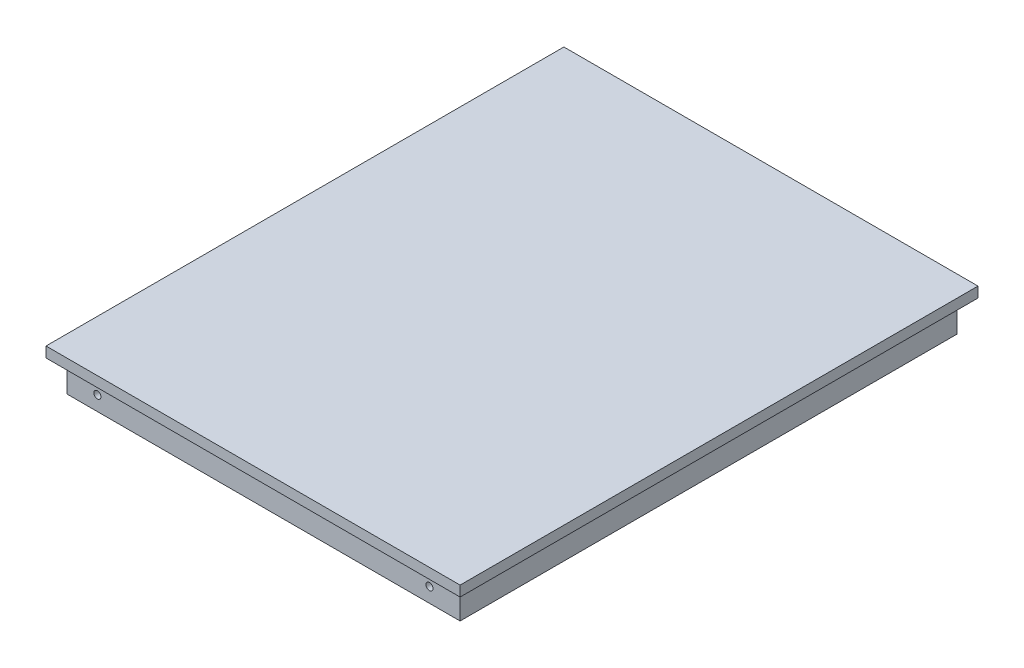
ISO-10303-21;
HEADER;
FILE_DESCRIPTION(('STEP AP214'),'2;1');
FILE_NAME('part.step','',(''),(''),'','','');
FILE_SCHEMA(('AUTOMOTIVE_DESIGN { 1 0 10303 214 1 1 1 1 }'));
ENDSEC;
DATA;
#1=APPLICATION_CONTEXT('core data for automotive mechanical design processes');
#2=APPLICATION_PROTOCOL_DEFINITION('international standard','automotive_design',2000,#1);
#3=PRODUCT_CONTEXT('',#1,'mechanical');
#4=PRODUCT('Part','Part','',(#3));
#5=PRODUCT_RELATED_PRODUCT_CATEGORY('part','',(#4));
#6=PRODUCT_DEFINITION_FORMATION('','',#4);
#7=PRODUCT_DEFINITION_CONTEXT('part definition',#1,'design');
#8=PRODUCT_DEFINITION('design','',#6,#7);
#9=PRODUCT_DEFINITION_SHAPE('','',#8);
#10=(LENGTH_UNIT() NAMED_UNIT(*) SI_UNIT(.MILLI.,.METRE.));
#11=(NAMED_UNIT(*) PLANE_ANGLE_UNIT() SI_UNIT($,.RADIAN.));
#12=(NAMED_UNIT(*) SI_UNIT($,.STERADIAN.) SOLID_ANGLE_UNIT());
#13=UNCERTAINTY_MEASURE_WITH_UNIT(LENGTH_MEASURE(1.E-05),#10,'distance_accuracy_value','');
#14=(GEOMETRIC_REPRESENTATION_CONTEXT(3) GLOBAL_UNCERTAINTY_ASSIGNED_CONTEXT((#13)) GLOBAL_UNIT_ASSIGNED_CONTEXT((#10,
#11,#12)) REPRESENTATION_CONTEXT('',''));
#15=CARTESIAN_POINT('',(0.,0.,0.));
#16=DIRECTION('',(0.,0.,1.));
#17=DIRECTION('',(1.,0.,0.));
#18=AXIS2_PLACEMENT_3D('',#15,#16,#17);
#19=CARTESIAN_POINT('',(0.,0.,0.));
#20=DIRECTION('',(0.,1.,0.));
#21=DIRECTION('',(0.,0.,1.));
#22=AXIS2_PLACEMENT_3D('',#19,#20,#21);
#23=PLANE('',#22);
#24=DIRECTION('',(0.,0.,-1.));
#25=VECTOR('',#24,1.);
#26=CARTESIAN_POINT('',(-99.75,0.,0.));
#27=LINE('',#26,#25);
#28=CARTESIAN_POINT('',(-99.75,0.,124.75));
#29=VERTEX_POINT('',#28);
#30=CARTESIAN_POINT('',(-99.75,0.,-124.75));
#31=VERTEX_POINT('',#30);
#32=EDGE_CURVE('E217',#29,#31,#27,.T.);
#33=ORIENTED_EDGE('',*,*,#32,.T.);
#34=DIRECTION('',(1.,0.,0.));
#35=VECTOR('',#34,1.);
#36=CARTESIAN_POINT('',(0.,0.,-124.75));
#37=LINE('',#36,#35);
#38=CARTESIAN_POINT('',(99.75,0.,-124.75));
#39=VERTEX_POINT('',#38);
#40=EDGE_CURVE('E241',#31,#39,#37,.T.);
#41=ORIENTED_EDGE('',*,*,#40,.T.);
#42=DIRECTION('',(0.,0.,1.));
#43=VECTOR('',#42,1.);
#44=CARTESIAN_POINT('',(99.75,0.,0.));
#45=LINE('',#44,#43);
#46=CARTESIAN_POINT('',(99.75,0.,124.75));
#47=VERTEX_POINT('',#46);
#48=EDGE_CURVE('E261',#39,#47,#45,.T.);
#49=ORIENTED_EDGE('',*,*,#48,.T.);
#50=DIRECTION('',(-1.,0.,0.));
#51=VECTOR('',#50,1.);
#52=CARTESIAN_POINT('',(0.,0.,124.75));
#53=LINE('',#52,#51);
#54=EDGE_CURVE('E257',#47,#29,#53,.T.);
#55=ORIENTED_EDGE('',*,*,#54,.T.);
#56=EDGE_LOOP('',(#33,#41,#49,#55));
#57=FACE_BOUND('',#56,.T.);
#58=DIRECTION('',(0.,0.,-1.));
#59=VECTOR('',#58,1.);
#60=CARTESIAN_POINT('',(-94.75,0.,0.));
#61=LINE('',#60,#59);
#62=CARTESIAN_POINT('',(-94.75,0.,119.75));
#63=VERTEX_POINT('',#62);
#64=CARTESIAN_POINT('',(-94.75,0.,-119.75));
#65=VERTEX_POINT('',#64);
#66=EDGE_CURVE('E194',#63,#65,#61,.T.);
#67=ORIENTED_EDGE('',*,*,#66,.F.);
#68=DIRECTION('',(-1.,0.,0.));
#69=VECTOR('',#68,1.);
#70=CARTESIAN_POINT('',(0.,0.,119.75));
#71=LINE('',#70,#69);
#72=CARTESIAN_POINT('',(94.75,0.,119.75));
#73=VERTEX_POINT('',#72);
#74=EDGE_CURVE('E154',#73,#63,#71,.T.);
#75=ORIENTED_EDGE('',*,*,#74,.F.);
#76=DIRECTION('',(0.,0.,1.));
#77=VECTOR('',#76,1.);
#78=CARTESIAN_POINT('',(94.75,0.,0.));
#79=LINE('',#78,#77);
#80=CARTESIAN_POINT('',(94.75,0.,-119.75));
#81=VERTEX_POINT('',#80);
#82=EDGE_CURVE('E70',#81,#73,#79,.T.);
#83=ORIENTED_EDGE('',*,*,#82,.F.);
#84=DIRECTION('',(1.,0.,0.));
#85=VECTOR('',#84,1.);
#86=CARTESIAN_POINT('',(0.,0.,-119.75));
#87=LINE('',#86,#85);
#88=EDGE_CURVE('E65',#65,#81,#87,.T.);
#89=ORIENTED_EDGE('',*,*,#88,.F.);
#90=EDGE_LOOP('',(#67,#75,#83,#89));
#91=FACE_BOUND('',#90,.T.);
#92=ADVANCED_FACE('F47',(#57,#91),#23,.F.);
#93=CARTESIAN_POINT('',(-99.75,5.,0.));
#94=DIRECTION('',(-1.,0.,0.));
#95=DIRECTION('',(0.,0.,1.));
#96=AXIS2_PLACEMENT_3D('',#93,#94,#95);
#97=PLANE('',#96);
#98=ORIENTED_EDGE('',*,*,#32,.F.);
#99=DIRECTION('',(0.,-1.,0.));
#100=VECTOR('',#99,1.);
#101=CARTESIAN_POINT('',(-99.75,5.,124.75));
#102=LINE('',#101,#100);
#103=CARTESIAN_POINT('',(-99.75,5.,124.75));
#104=VERTEX_POINT('',#103);
#105=EDGE_CURVE('E11',#104,#29,#102,.T.);
#106=ORIENTED_EDGE('',*,*,#105,.F.);
#107=DIRECTION('',(0.,0.,-1.));
#108=VECTOR('',#107,1.);
#109=CARTESIAN_POINT('',(-99.75,5.,0.));
#110=LINE('',#109,#108);
#111=CARTESIAN_POINT('',(-99.75,5.,-124.75));
#112=VERTEX_POINT('',#111);
#113=EDGE_CURVE('E236',#104,#112,#110,.T.);
#114=ORIENTED_EDGE('',*,*,#113,.T.);
#115=DIRECTION('',(0.,-1.,0.));
#116=VECTOR('',#115,1.);
#117=CARTESIAN_POINT('',(-99.75,5.,-124.75));
#118=LINE('',#117,#116);
#119=EDGE_CURVE('E253',#112,#31,#118,.T.);
#120=ORIENTED_EDGE('',*,*,#119,.T.);
#121=EDGE_LOOP('',(#98,#106,#114,#120));
#122=FACE_BOUND('',#121,.T.);
#123=ADVANCED_FACE('F49',(#122),#97,.T.);
#124=CARTESIAN_POINT('',(0.,5.,124.75));
#125=DIRECTION('',(0.,0.,1.));
#126=DIRECTION('',(1.,0.,0.));
#127=AXIS2_PLACEMENT_3D('',#124,#125,#126);
#128=PLANE('',#127);
#129=ORIENTED_EDGE('',*,*,#54,.F.);
#130=DIRECTION('',(0.,-1.,0.));
#131=VECTOR('',#130,1.);
#132=CARTESIAN_POINT('',(99.75,5.,124.75));
#133=LINE('',#132,#131);
#134=CARTESIAN_POINT('',(99.75,5.,124.75));
#135=VERTEX_POINT('',#134);
#136=EDGE_CURVE('E57',#135,#47,#133,.T.);
#137=ORIENTED_EDGE('',*,*,#136,.F.);
#138=DIRECTION('',(-1.,0.,0.));
#139=VECTOR('',#138,1.);
#140=CARTESIAN_POINT('',(0.,5.,124.75));
#141=LINE('',#140,#139);
#142=EDGE_CURVE('E240',#135,#104,#141,.T.);
#143=ORIENTED_EDGE('',*,*,#142,.T.);
#144=ORIENTED_EDGE('',*,*,#105,.T.);
#145=EDGE_LOOP('',(#129,#137,#143,#144));
#146=FACE_BOUND('',#145,.T.);
#147=ADVANCED_FACE('F351',(#146),#128,.T.);
#148=CARTESIAN_POINT('',(99.75,5.,0.));
#149=DIRECTION('',(1.,0.,0.));
#150=DIRECTION('',(0.,0.,-1.));
#151=AXIS2_PLACEMENT_3D('',#148,#149,#150);
#152=PLANE('',#151);
#153=ORIENTED_EDGE('',*,*,#48,.F.);
#154=DIRECTION('',(0.,-1.,0.));
#155=VECTOR('',#154,1.);
#156=CARTESIAN_POINT('',(99.75,5.,-124.75));
#157=LINE('',#156,#155);
#158=CARTESIAN_POINT('',(99.75,5.,-124.75));
#159=VERTEX_POINT('',#158);
#160=EDGE_CURVE('E270',#159,#39,#157,.T.);
#161=ORIENTED_EDGE('',*,*,#160,.F.);
#162=DIRECTION('',(0.,0.,1.));
#163=VECTOR('',#162,1.);
#164=CARTESIAN_POINT('',(99.75,5.,0.));
#165=LINE('',#164,#163);
#166=EDGE_CURVE('E245',#159,#135,#165,.T.);
#167=ORIENTED_EDGE('',*,*,#166,.T.);
#168=ORIENTED_EDGE('',*,*,#136,.T.);
#169=EDGE_LOOP('',(#153,#161,#167,#168));
#170=FACE_BOUND('',#169,.T.);
#171=ADVANCED_FACE('F398',(#170),#152,.T.);
#172=CARTESIAN_POINT('',(0.,5.,-124.75));
#173=DIRECTION('',(0.,0.,-1.));
#174=DIRECTION('',(-1.,0.,0.));
#175=AXIS2_PLACEMENT_3D('',#172,#173,#174);
#176=PLANE('',#175);
#177=ORIENTED_EDGE('',*,*,#40,.F.);
#178=ORIENTED_EDGE('',*,*,#119,.F.);
#179=DIRECTION('',(1.,0.,0.));
#180=VECTOR('',#179,1.);
#181=CARTESIAN_POINT('',(0.,5.,-124.75));
#182=LINE('',#181,#180);
#183=EDGE_CURVE('E249',#112,#159,#182,.T.);
#184=ORIENTED_EDGE('',*,*,#183,.T.);
#185=ORIENTED_EDGE('',*,*,#160,.T.);
#186=EDGE_LOOP('',(#177,#178,#184,#185));
#187=FACE_BOUND('',#186,.T.);
#188=ADVANCED_FACE('F393',(#187),#176,.T.);
#189=CARTESIAN_POINT('',(0.,5.,0.));
#190=DIRECTION('',(0.,1.,0.));
#191=DIRECTION('',(0.,0.,1.));
#192=AXIS2_PLACEMENT_3D('',#189,#190,#191);
#193=PLANE('',#192);
#194=ORIENTED_EDGE('',*,*,#113,.F.);
#195=ORIENTED_EDGE('',*,*,#142,.F.);
#196=ORIENTED_EDGE('',*,*,#166,.F.);
#197=ORIENTED_EDGE('',*,*,#183,.F.);
#198=EDGE_LOOP('',(#194,#195,#196,#197));
#199=FACE_BOUND('',#198,.T.);
#200=ADVANCED_FACE('F311',(#199),#193,.T.);
#201=CARTESIAN_POINT('',(0.,-15.,114.75));
#202=DIRECTION('',(0.,0.,-1.));
#203=DIRECTION('',(-1.,0.,0.));
#204=AXIS2_PLACEMENT_3D('',#201,#202,#203);
#205=PLANE('',#204);
#206=CARTESIAN_POINT('',(-80.,-8.00000000000001,114.75));
#207=DIRECTION('',(0.,0.,-1.));
#208=DIRECTION('',(-1.,0.,0.));
#209=AXIS2_PLACEMENT_3D('',#206,#207,#208);
#210=CIRCLE('',#209,1.69999999999997);
#211=CARTESIAN_POINT('',(-81.7,-8.00000000000001,114.75));
#212=VERTEX_POINT('',#211);
#213=EDGE_CURVE('E279',#212,#212,#210,.T.);
#214=ORIENTED_EDGE('',*,*,#213,.F.);
#215=EDGE_LOOP('',(#214));
#216=FACE_BOUND('',#215,.T.);
#217=CARTESIAN_POINT('',(80.,-7.99999999999999,114.75));
#218=DIRECTION('',(0.,0.,-1.));
#219=DIRECTION('',(-1.,0.,0.));
#220=AXIS2_PLACEMENT_3D('',#217,#218,#219);
#221=CIRCLE('',#220,1.69999999999997);
#222=CARTESIAN_POINT('',(78.3,-7.99999999999999,114.75));
#223=VERTEX_POINT('',#222);
#224=EDGE_CURVE('E171',#223,#223,#221,.T.);
#225=ORIENTED_EDGE('',*,*,#224,.F.);
#226=EDGE_LOOP('',(#225));
#227=FACE_BOUND('',#226,.T.);
#228=DIRECTION('',(-1.,0.,0.));
#229=VECTOR('',#228,1.);
#230=CARTESIAN_POINT('',(0.,0.,114.75));
#231=LINE('',#230,#229);
#232=CARTESIAN_POINT('',(89.75,0.,114.75));
#233=VERTEX_POINT('',#232);
#234=CARTESIAN_POINT('',(-89.75,0.,114.75));
#235=VERTEX_POINT('',#234);
#236=EDGE_CURVE('E203',#233,#235,#231,.T.);
#237=ORIENTED_EDGE('',*,*,#236,.F.);
#238=DIRECTION('',(0.,1.,0.));
#239=VECTOR('',#238,1.);
#240=CARTESIAN_POINT('',(89.75,-15.,114.75));
#241=LINE('',#240,#239);
#242=CARTESIAN_POINT('',(89.75,-15.,114.75));
#243=VERTEX_POINT('',#242);
#244=EDGE_CURVE('E214',#243,#233,#241,.T.);
#245=ORIENTED_EDGE('',*,*,#244,.F.);
#246=DIRECTION('',(-1.,0.,0.));
#247=VECTOR('',#246,1.);
#248=CARTESIAN_POINT('',(0.,-15.,114.75));
#249=LINE('',#248,#247);
#250=CARTESIAN_POINT('',(-89.75,-15.,114.75));
#251=VERTEX_POINT('',#250);
#252=EDGE_CURVE('E179',#243,#251,#249,.T.);
#253=ORIENTED_EDGE('',*,*,#252,.T.);
#254=DIRECTION('',(0.,1.,0.));
#255=VECTOR('',#254,1.);
#256=CARTESIAN_POINT('',(-89.75,-15.,114.75));
#257=LINE('',#256,#255);
#258=EDGE_CURVE('E225',#251,#235,#257,.T.);
#259=ORIENTED_EDGE('',*,*,#258,.T.);
#260=EDGE_LOOP('',(#237,#245,#253,#259));
#261=FACE_BOUND('',#260,.T.);
#262=ADVANCED_FACE('F307',(#216,#227,#261),#205,.T.);
#263=CARTESIAN_POINT('',(89.75,-15.,0.));
#264=DIRECTION('',(-1.,0.,0.));
#265=DIRECTION('',(0.,0.,1.));
#266=AXIS2_PLACEMENT_3D('',#263,#264,#265);
#267=PLANE('',#266);
#268=DIRECTION('',(0.,0.,1.));
#269=VECTOR('',#268,1.);
#270=CARTESIAN_POINT('',(89.75,0.,0.));
#271=LINE('',#270,#269);
#272=CARTESIAN_POINT('',(89.75,0.,-114.75));
#273=VERTEX_POINT('',#272);
#274=EDGE_CURVE('E164',#273,#233,#271,.T.);
#275=ORIENTED_EDGE('',*,*,#274,.F.);
#276=DIRECTION('',(0.,1.,0.));
#277=VECTOR('',#276,1.);
#278=CARTESIAN_POINT('',(89.75,-15.,-114.75));
#279=LINE('',#278,#277);
#280=CARTESIAN_POINT('',(89.75,-15.,-114.75));
#281=VERTEX_POINT('',#280);
#282=EDGE_CURVE('E218',#281,#273,#279,.T.);
#283=ORIENTED_EDGE('',*,*,#282,.F.);
#284=DIRECTION('',(0.,0.,1.));
#285=VECTOR('',#284,1.);
#286=CARTESIAN_POINT('',(89.75,-15.,0.));
#287=LINE('',#286,#285);
#288=EDGE_CURVE('E159',#281,#243,#287,.T.);
#289=ORIENTED_EDGE('',*,*,#288,.T.);
#290=ORIENTED_EDGE('',*,*,#244,.T.);
#291=EDGE_LOOP('',(#275,#283,#289,#290));
#292=FACE_BOUND('',#291,.T.);
#293=ADVANCED_FACE('F310',(#292),#267,.T.);
#294=CARTESIAN_POINT('',(0.,-15.,-114.75));
#295=DIRECTION('',(0.,0.,1.));
#296=DIRECTION('',(1.,0.,0.));
#297=AXIS2_PLACEMENT_3D('',#294,#295,#296);
#298=PLANE('',#297);
#299=CARTESIAN_POINT('',(-80.,-8.00000000000001,-114.75));
#300=DIRECTION('',(0.,0.,1.));
#301=DIRECTION('',(1.,0.,0.));
#302=AXIS2_PLACEMENT_3D('',#299,#300,#301);
#303=CIRCLE('',#302,1.69999999999997);
#304=CARTESIAN_POINT('',(-78.3,-8.00000000000001,-114.75));
#305=VERTEX_POINT('',#304);
#306=EDGE_CURVE('E287',#305,#305,#303,.T.);
#307=ORIENTED_EDGE('',*,*,#306,.F.);
#308=EDGE_LOOP('',(#307));
#309=FACE_BOUND('',#308,.T.);
#310=CARTESIAN_POINT('',(80.,-7.99999999999999,-114.75));
#311=DIRECTION('',(0.,0.,1.));
#312=DIRECTION('',(1.,0.,0.));
#313=AXIS2_PLACEMENT_3D('',#310,#311,#312);
#314=CIRCLE('',#313,1.69999999999997);
#315=CARTESIAN_POINT('',(81.7,-7.99999999999999,-114.75));
#316=VERTEX_POINT('',#315);
#317=EDGE_CURVE('E284',#316,#316,#314,.T.);
#318=ORIENTED_EDGE('',*,*,#317,.F.);
#319=EDGE_LOOP('',(#318));
#320=FACE_BOUND('',#319,.T.);
#321=DIRECTION('',(1.,0.,0.));
#322=VECTOR('',#321,1.);
#323=CARTESIAN_POINT('',(0.,0.,-114.75));
#324=LINE('',#323,#322);
#325=CARTESIAN_POINT('',(-89.75,0.,-114.75));
#326=VERTEX_POINT('',#325);
#327=EDGE_CURVE('E168',#326,#273,#324,.T.);
#328=ORIENTED_EDGE('',*,*,#327,.F.);
#329=DIRECTION('',(0.,1.,0.));
#330=VECTOR('',#329,1.);
#331=CARTESIAN_POINT('',(-89.75,-15.,-114.75));
#332=LINE('',#331,#330);
#333=CARTESIAN_POINT('',(-89.75,-15.,-114.75));
#334=VERTEX_POINT('',#333);
#335=EDGE_CURVE('E221',#334,#326,#332,.T.);
#336=ORIENTED_EDGE('',*,*,#335,.F.);
#337=DIRECTION('',(1.,0.,0.));
#338=VECTOR('',#337,1.);
#339=CARTESIAN_POINT('',(0.,-15.,-114.75));
#340=LINE('',#339,#338);
#341=EDGE_CURVE('E187',#334,#281,#340,.T.);
#342=ORIENTED_EDGE('',*,*,#341,.T.);
#343=ORIENTED_EDGE('',*,*,#282,.T.);
#344=EDGE_LOOP('',(#328,#336,#342,#343));
#345=FACE_BOUND('',#344,.T.);
#346=ADVANCED_FACE('F329',(#309,#320,#345),#298,.T.);
#347=CARTESIAN_POINT('',(-94.75,-15.,0.));
#348=DIRECTION('',(1.,0.,0.));
#349=DIRECTION('',(0.,0.,-1.));
#350=AXIS2_PLACEMENT_3D('',#347,#348,#349);
#351=PLANE('',#350);
#352=ORIENTED_EDGE('',*,*,#66,.T.);
#353=DIRECTION('',(0.,1.,0.));
#354=VECTOR('',#353,1.);
#355=CARTESIAN_POINT('',(-94.75,-15.,-119.75));
#356=LINE('',#355,#354);
#357=CARTESIAN_POINT('',(-94.75,-15.,-119.75));
#358=VERTEX_POINT('',#357);
#359=EDGE_CURVE('E162',#358,#65,#356,.T.);
#360=ORIENTED_EDGE('',*,*,#359,.F.);
#361=DIRECTION('',(0.,0.,-1.));
#362=VECTOR('',#361,1.);
#363=CARTESIAN_POINT('',(-94.75,-15.,0.));
#364=LINE('',#363,#362);
#365=CARTESIAN_POINT('',(-94.75,-15.,119.75));
#366=VERTEX_POINT('',#365);
#367=EDGE_CURVE('E141',#366,#358,#364,.T.);
#368=ORIENTED_EDGE('',*,*,#367,.F.);
#369=DIRECTION('',(0.,1.,0.));
#370=VECTOR('',#369,1.);
#371=CARTESIAN_POINT('',(-94.75,-15.,119.75));
#372=LINE('',#371,#370);
#373=EDGE_CURVE('E152',#366,#63,#372,.T.);
#374=ORIENTED_EDGE('',*,*,#373,.T.);
#375=EDGE_LOOP('',(#352,#360,#368,#374));
#376=FACE_BOUND('',#375,.T.);
#377=ADVANCED_FACE('F161',(#376),#351,.F.);
#378=CARTESIAN_POINT('',(0.,-15.,-119.75));
#379=DIRECTION('',(0.,0.,1.));
#380=DIRECTION('',(1.,0.,0.));
#381=AXIS2_PLACEMENT_3D('',#378,#379,#380);
#382=PLANE('',#381);
#383=CARTESIAN_POINT('',(-80.,-8.00000000000001,-119.75));
#384=DIRECTION('',(0.,0.,1.));
#385=DIRECTION('',(1.,0.,0.));
#386=AXIS2_PLACEMENT_3D('',#383,#384,#385);
#387=CIRCLE('',#386,1.69999999999997);
#388=CARTESIAN_POINT('',(-78.3,-8.00000000000001,-119.75));
#389=VERTEX_POINT('',#388);
#390=EDGE_CURVE('E51',#389,#389,#387,.T.);
#391=ORIENTED_EDGE('',*,*,#390,.T.);
#392=EDGE_LOOP('',(#391));
#393=FACE_BOUND('',#392,.T.);
#394=CARTESIAN_POINT('',(80.,-7.99999999999999,-119.75));
#395=DIRECTION('',(0.,0.,1.));
#396=DIRECTION('',(1.,0.,0.));
#397=AXIS2_PLACEMENT_3D('',#394,#395,#396);
#398=CIRCLE('',#397,1.69999999999997);
#399=CARTESIAN_POINT('',(81.7,-7.99999999999999,-119.75));
#400=VERTEX_POINT('',#399);
#401=EDGE_CURVE('E283',#400,#400,#398,.T.);
#402=ORIENTED_EDGE('',*,*,#401,.T.);
#403=EDGE_LOOP('',(#402));
#404=FACE_BOUND('',#403,.T.);
#405=ORIENTED_EDGE('',*,*,#88,.T.);
#406=DIRECTION('',(0.,1.,0.));
#407=VECTOR('',#406,1.);
#408=CARTESIAN_POINT('',(94.75,-15.,-119.75));
#409=LINE('',#408,#407);
#410=CARTESIAN_POINT('',(94.75,-15.,-119.75));
#411=VERTEX_POINT('',#410);
#412=EDGE_CURVE('E230',#411,#81,#409,.T.);
#413=ORIENTED_EDGE('',*,*,#412,.F.);
#414=DIRECTION('',(1.,0.,0.));
#415=VECTOR('',#414,1.);
#416=CARTESIAN_POINT('',(0.,-15.,-119.75));
#417=LINE('',#416,#415);
#418=EDGE_CURVE('E176',#358,#411,#417,.T.);
#419=ORIENTED_EDGE('',*,*,#418,.F.);
#420=ORIENTED_EDGE('',*,*,#359,.T.);
#421=EDGE_LOOP('',(#405,#413,#419,#420));
#422=FACE_BOUND('',#421,.T.);
#423=ADVANCED_FACE('F338',(#393,#404,#422),#382,.F.);
#424=CARTESIAN_POINT('',(94.75,-15.,0.));
#425=DIRECTION('',(-1.,0.,0.));
#426=DIRECTION('',(0.,0.,1.));
#427=AXIS2_PLACEMENT_3D('',#424,#425,#426);
#428=PLANE('',#427);
#429=ORIENTED_EDGE('',*,*,#82,.T.);
#430=DIRECTION('',(0.,1.,0.));
#431=VECTOR('',#430,1.);
#432=CARTESIAN_POINT('',(94.75,-15.,119.75));
#433=LINE('',#432,#431);
#434=CARTESIAN_POINT('',(94.75,-15.,119.75));
#435=VERTEX_POINT('',#434);
#436=EDGE_CURVE('E158',#435,#73,#433,.T.);
#437=ORIENTED_EDGE('',*,*,#436,.F.);
#438=DIRECTION('',(0.,0.,1.));
#439=VECTOR('',#438,1.);
#440=CARTESIAN_POINT('',(94.75,-15.,0.));
#441=LINE('',#440,#439);
#442=EDGE_CURVE('E144',#411,#435,#441,.T.);
#443=ORIENTED_EDGE('',*,*,#442,.F.);
#444=ORIENTED_EDGE('',*,*,#412,.T.);
#445=EDGE_LOOP('',(#429,#437,#443,#444));
#446=FACE_BOUND('',#445,.T.);
#447=ADVANCED_FACE('F380',(#446),#428,.F.);
#448=CARTESIAN_POINT('',(0.,-15.,119.75));
#449=DIRECTION('',(0.,0.,-1.));
#450=DIRECTION('',(-1.,0.,0.));
#451=AXIS2_PLACEMENT_3D('',#448,#449,#450);
#452=PLANE('',#451);
#453=CARTESIAN_POINT('',(-80.,-8.00000000000001,119.75));
#454=DIRECTION('',(0.,0.,-1.));
#455=DIRECTION('',(-1.,0.,0.));
#456=AXIS2_PLACEMENT_3D('',#453,#454,#455);
#457=CIRCLE('',#456,1.69999999999997);
#458=CARTESIAN_POINT('',(-81.7,-8.00000000000001,119.75));
#459=VERTEX_POINT('',#458);
#460=EDGE_CURVE('E280',#459,#459,#457,.T.);
#461=ORIENTED_EDGE('',*,*,#460,.T.);
#462=EDGE_LOOP('',(#461));
#463=FACE_BOUND('',#462,.T.);
#464=CARTESIAN_POINT('',(80.,-7.99999999999999,119.75));
#465=DIRECTION('',(0.,0.,-1.));
#466=DIRECTION('',(-1.,0.,0.));
#467=AXIS2_PLACEMENT_3D('',#464,#465,#466);
#468=CIRCLE('',#467,1.69999999999997);
#469=CARTESIAN_POINT('',(78.3,-7.99999999999999,119.75));
#470=VERTEX_POINT('',#469);
#471=EDGE_CURVE('E275',#470,#470,#468,.T.);
#472=ORIENTED_EDGE('',*,*,#471,.T.);
#473=EDGE_LOOP('',(#472));
#474=FACE_BOUND('',#473,.T.);
#475=ORIENTED_EDGE('',*,*,#74,.T.);
#476=ORIENTED_EDGE('',*,*,#373,.F.);
#477=DIRECTION('',(-1.,0.,0.));
#478=VECTOR('',#477,1.);
#479=CARTESIAN_POINT('',(0.,-15.,119.75));
#480=LINE('',#479,#478);
#481=EDGE_CURVE('E136',#435,#366,#480,.T.);
#482=ORIENTED_EDGE('',*,*,#481,.F.);
#483=ORIENTED_EDGE('',*,*,#436,.T.);
#484=EDGE_LOOP('',(#475,#476,#482,#483));
#485=FACE_BOUND('',#484,.T.);
#486=ADVANCED_FACE('F153',(#463,#474,#485),#452,.F.);
#487=CARTESIAN_POINT('',(-89.75,-15.,0.));
#488=DIRECTION('',(1.,0.,0.));
#489=DIRECTION('',(0.,0.,-1.));
#490=AXIS2_PLACEMENT_3D('',#487,#488,#489);
#491=PLANE('',#490);
#492=DIRECTION('',(0.,0.,-1.));
#493=VECTOR('',#492,1.);
#494=CARTESIAN_POINT('',(-89.75,0.,0.));
#495=LINE('',#494,#493);
#496=EDGE_CURVE('E207',#235,#326,#495,.T.);
#497=ORIENTED_EDGE('',*,*,#496,.F.);
#498=ORIENTED_EDGE('',*,*,#258,.F.);
#499=DIRECTION('',(0.,0.,-1.));
#500=VECTOR('',#499,1.);
#501=CARTESIAN_POINT('',(-89.75,-15.,0.));
#502=LINE('',#501,#500);
#503=EDGE_CURVE('E183',#251,#334,#502,.T.);
#504=ORIENTED_EDGE('',*,*,#503,.T.);
#505=ORIENTED_EDGE('',*,*,#335,.T.);
#506=EDGE_LOOP('',(#497,#498,#504,#505));
#507=FACE_BOUND('',#506,.T.);
#508=ADVANCED_FACE('F327',(#507),#491,.T.);
#509=CARTESIAN_POINT('',(0.,-15.,0.));
#510=DIRECTION('',(0.,1.,0.));
#511=DIRECTION('',(0.,0.,1.));
#512=AXIS2_PLACEMENT_3D('',#509,#510,#511);
#513=PLANE('',#512);
#514=ORIENTED_EDGE('',*,*,#367,.T.);
#515=ORIENTED_EDGE('',*,*,#418,.T.);
#516=ORIENTED_EDGE('',*,*,#442,.T.);
#517=ORIENTED_EDGE('',*,*,#481,.T.);
#518=EDGE_LOOP('',(#514,#515,#516,#517));
#519=FACE_BOUND('',#518,.T.);
#520=ORIENTED_EDGE('',*,*,#252,.F.);
#521=ORIENTED_EDGE('',*,*,#288,.F.);
#522=ORIENTED_EDGE('',*,*,#341,.F.);
#523=ORIENTED_EDGE('',*,*,#503,.F.);
#524=EDGE_LOOP('',(#520,#521,#522,#523));
#525=FACE_BOUND('',#524,.T.);
#526=ADVANCED_FACE('F138',(#519,#525),#513,.F.);
#527=ORIENTED_EDGE('',*,*,#274,.T.);
#528=ORIENTED_EDGE('',*,*,#236,.T.);
#529=ORIENTED_EDGE('',*,*,#496,.T.);
#530=ORIENTED_EDGE('',*,*,#327,.T.);
#531=EDGE_LOOP('',(#527,#528,#529,#530));
#532=FACE_BOUND('',#531,.T.);
#533=ADVANCED_FACE('F321',(#532),#23,.F.);
#534=CARTESIAN_POINT('',(80.,-7.99999999999999,0.));
#535=DIRECTION('',(0.,0.,-1.));
#536=DIRECTION('',(-1.,0.,0.));
#537=AXIS2_PLACEMENT_3D('',#534,#535,#536);
#538=CYLINDRICAL_SURFACE('',#537,1.69999999999997);
#539=ORIENTED_EDGE('',*,*,#224,.T.);
#540=EDGE_LOOP('',(#539));
#541=FACE_BOUND('',#540,.T.);
#542=ORIENTED_EDGE('',*,*,#471,.F.);
#543=EDGE_LOOP('',(#542));
#544=FACE_BOUND('',#543,.T.);
#545=ADVANCED_FACE('F356',(#541,#544),#538,.F.);
#546=CARTESIAN_POINT('',(-80.,-8.00000000000001,0.));
#547=DIRECTION('',(0.,0.,-1.));
#548=DIRECTION('',(-1.,0.,0.));
#549=AXIS2_PLACEMENT_3D('',#546,#547,#548);
#550=CYLINDRICAL_SURFACE('',#549,1.69999999999997);
#551=ORIENTED_EDGE('',*,*,#213,.T.);
#552=EDGE_LOOP('',(#551));
#553=FACE_BOUND('',#552,.T.);
#554=ORIENTED_EDGE('',*,*,#460,.F.);
#555=EDGE_LOOP('',(#554));
#556=FACE_BOUND('',#555,.T.);
#557=ADVANCED_FACE('F304',(#553,#556),#550,.F.);
#558=CARTESIAN_POINT('',(80.,-7.99999999999999,0.));
#559=DIRECTION('',(0.,0.,1.));
#560=DIRECTION('',(1.,0.,0.));
#561=AXIS2_PLACEMENT_3D('',#558,#559,#560);
#562=CYLINDRICAL_SURFACE('',#561,1.69999999999997);
#563=ORIENTED_EDGE('',*,*,#317,.T.);
#564=EDGE_LOOP('',(#563));
#565=FACE_BOUND('',#564,.T.);
#566=ORIENTED_EDGE('',*,*,#401,.F.);
#567=EDGE_LOOP('',(#566));
#568=FACE_BOUND('',#567,.T.);
#569=ADVANCED_FACE('F369',(#565,#568),#562,.F.);
#570=CARTESIAN_POINT('',(-80.,-8.00000000000001,0.));
#571=DIRECTION('',(0.,0.,1.));
#572=DIRECTION('',(1.,0.,0.));
#573=AXIS2_PLACEMENT_3D('',#570,#571,#572);
#574=CYLINDRICAL_SURFACE('',#573,1.69999999999997);
#575=ORIENTED_EDGE('',*,*,#306,.T.);
#576=EDGE_LOOP('',(#575));
#577=FACE_BOUND('',#576,.T.);
#578=ORIENTED_EDGE('',*,*,#390,.F.);
#579=EDGE_LOOP('',(#578));
#580=FACE_BOUND('',#579,.T.);
#581=ADVANCED_FACE('F372',(#577,#580),#574,.F.);
#582=CLOSED_SHELL('',(#92,#123,#147,#171,#188,#200,#262,#293,#346,#377,#423,#447,#486,#508,#526,
#533,#545,#557,#569,#581));
#583=MANIFOLD_SOLID_BREP('B2',#582);
#584=ADVANCED_BREP_SHAPE_REPRESENTATION('',(#18,#583),#14);
#585=SHAPE_DEFINITION_REPRESENTATION(#9,#584);
ENDSEC;
END-ISO-10303-21;
